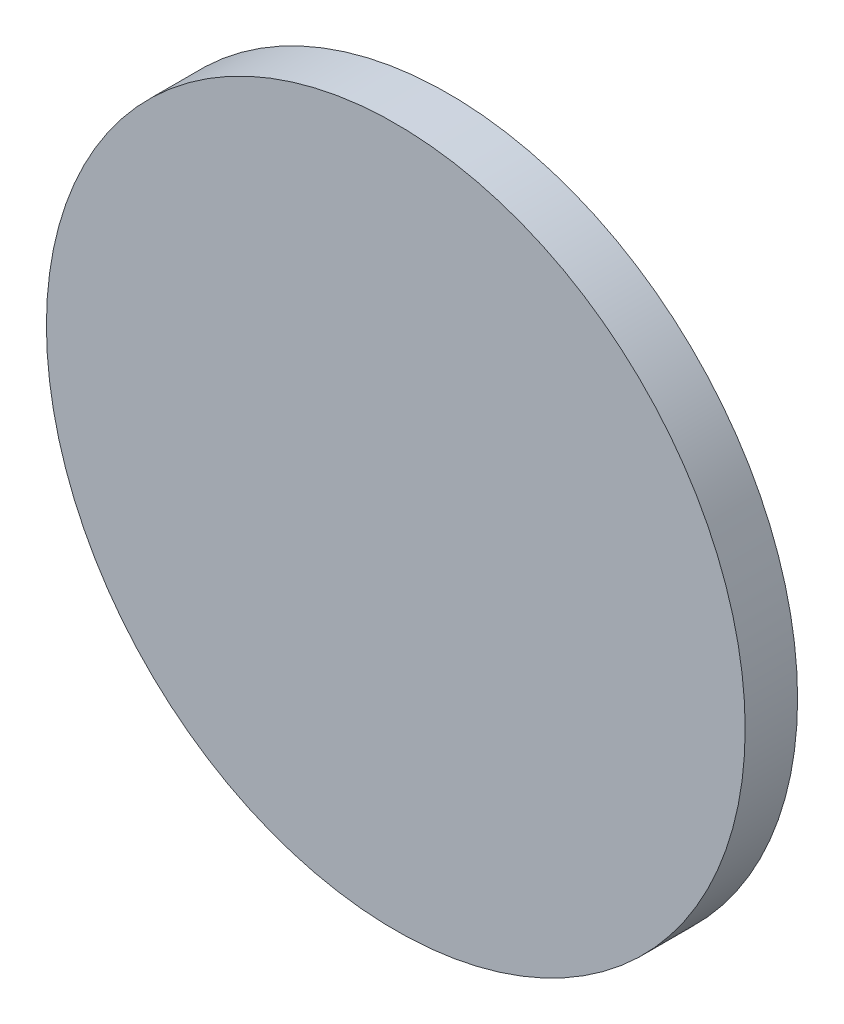
ISO-10303-21;
HEADER;
FILE_DESCRIPTION(('STEP AP214'),'2;1');
FILE_NAME('part.step','',(''),(''),'','','');
FILE_SCHEMA(('AUTOMOTIVE_DESIGN { 1 0 10303 214 1 1 1 1 }'));
ENDSEC;
DATA;
#1=APPLICATION_CONTEXT('core data for automotive mechanical design processes');
#2=APPLICATION_PROTOCOL_DEFINITION('international standard','automotive_design',2000,#1);
#3=PRODUCT_CONTEXT('',#1,'mechanical');
#4=PRODUCT('Part','Part','',(#3));
#5=PRODUCT_RELATED_PRODUCT_CATEGORY('part','',(#4));
#6=PRODUCT_DEFINITION_FORMATION('','',#4);
#7=PRODUCT_DEFINITION_CONTEXT('part definition',#1,'design');
#8=PRODUCT_DEFINITION('design','',#6,#7);
#9=PRODUCT_DEFINITION_SHAPE('','',#8);
#10=(LENGTH_UNIT() NAMED_UNIT(*) SI_UNIT(.MILLI.,.METRE.));
#11=(NAMED_UNIT(*) PLANE_ANGLE_UNIT() SI_UNIT($,.RADIAN.));
#12=(NAMED_UNIT(*) SI_UNIT($,.STERADIAN.) SOLID_ANGLE_UNIT());
#13=UNCERTAINTY_MEASURE_WITH_UNIT(LENGTH_MEASURE(1.E-05),#10,'distance_accuracy_value','');
#14=(GEOMETRIC_REPRESENTATION_CONTEXT(3) GLOBAL_UNCERTAINTY_ASSIGNED_CONTEXT((#13)) GLOBAL_UNIT_ASSIGNED_CONTEXT((#10,
#11,#12)) REPRESENTATION_CONTEXT('',''));
#15=CARTESIAN_POINT('',(0.,0.,0.));
#16=DIRECTION('',(0.,0.,1.));
#17=DIRECTION('',(1.,0.,0.));
#18=AXIS2_PLACEMENT_3D('',#15,#16,#17);
#19=CARTESIAN_POINT('',(6.25416,16.03491,0.79916));
#20=DIRECTION('',(0.,0.,1.));
#21=DIRECTION('',(1.,0.,0.));
#22=AXIS2_PLACEMENT_3D('',#19,#20,#21);
#23=PLANE('',#22);
#24=CARTESIAN_POINT('',(6.25416,16.03491,0.79916));
#25=DIRECTION('',(0.,0.,1.));
#26=DIRECTION('',(1.,0.,0.));
#27=AXIS2_PLACEMENT_3D('',#24,#25,#26);
#28=CIRCLE('',#27,0.2286);
#29=CARTESIAN_POINT('',(6.48276,16.03491,0.79916));
#30=VERTEX_POINT('',#29);
#31=EDGE_CURVE('E18',#30,#30,#28,.F.);
#32=ORIENTED_EDGE('',*,*,#31,.F.);
#33=EDGE_LOOP('',(#32));
#34=FACE_BOUND('',#33,.T.);
#35=ADVANCED_FACE('F15',(#34),#23,.T.);
#36=CARTESIAN_POINT('',(6.25416,16.03491,0.76487));
#37=DIRECTION('',(0.,0.,1.));
#38=DIRECTION('',(1.,0.,0.));
#39=AXIS2_PLACEMENT_3D('',#36,#37,#38);
#40=CYLINDRICAL_SURFACE('',#39,0.2286);
#41=ORIENTED_EDGE('',*,*,#31,.T.);
#42=EDGE_LOOP('',(#41));
#43=FACE_BOUND('',#42,.T.);
#44=CARTESIAN_POINT('',(6.25416,16.03491,0.76487));
#45=DIRECTION('',(0.,0.,1.));
#46=DIRECTION('',(1.,0.,0.));
#47=AXIS2_PLACEMENT_3D('',#44,#45,#46);
#48=CIRCLE('',#47,0.2286);
#49=CARTESIAN_POINT('',(6.48276,16.03491,0.76487));
#50=VERTEX_POINT('',#49);
#51=EDGE_CURVE('E10',#50,#50,#48,.F.);
#52=ORIENTED_EDGE('',*,*,#51,.F.);
#53=EDGE_LOOP('',(#52));
#54=FACE_BOUND('',#53,.T.);
#55=ADVANCED_FACE('F27',(#43,#54),#40,.T.);
#56=CARTESIAN_POINT('',(6.25416,16.03491,0.76487));
#57=DIRECTION('',(0.,0.,-1.));
#58=DIRECTION('',(-1.,0.,0.));
#59=AXIS2_PLACEMENT_3D('',#56,#57,#58);
#60=PLANE('',#59);
#61=ORIENTED_EDGE('',*,*,#51,.T.);
#62=EDGE_LOOP('',(#61));
#63=FACE_BOUND('',#62,.T.);
#64=ADVANCED_FACE('F35',(#63),#60,.T.);
#65=CLOSED_SHELL('',(#35,#55,#64));
#66=MANIFOLD_SOLID_BREP('B1',#65);
#67=ADVANCED_BREP_SHAPE_REPRESENTATION('',(#18,#66),#14);
#68=SHAPE_DEFINITION_REPRESENTATION(#9,#67);
ENDSEC;
END-ISO-10303-21;
